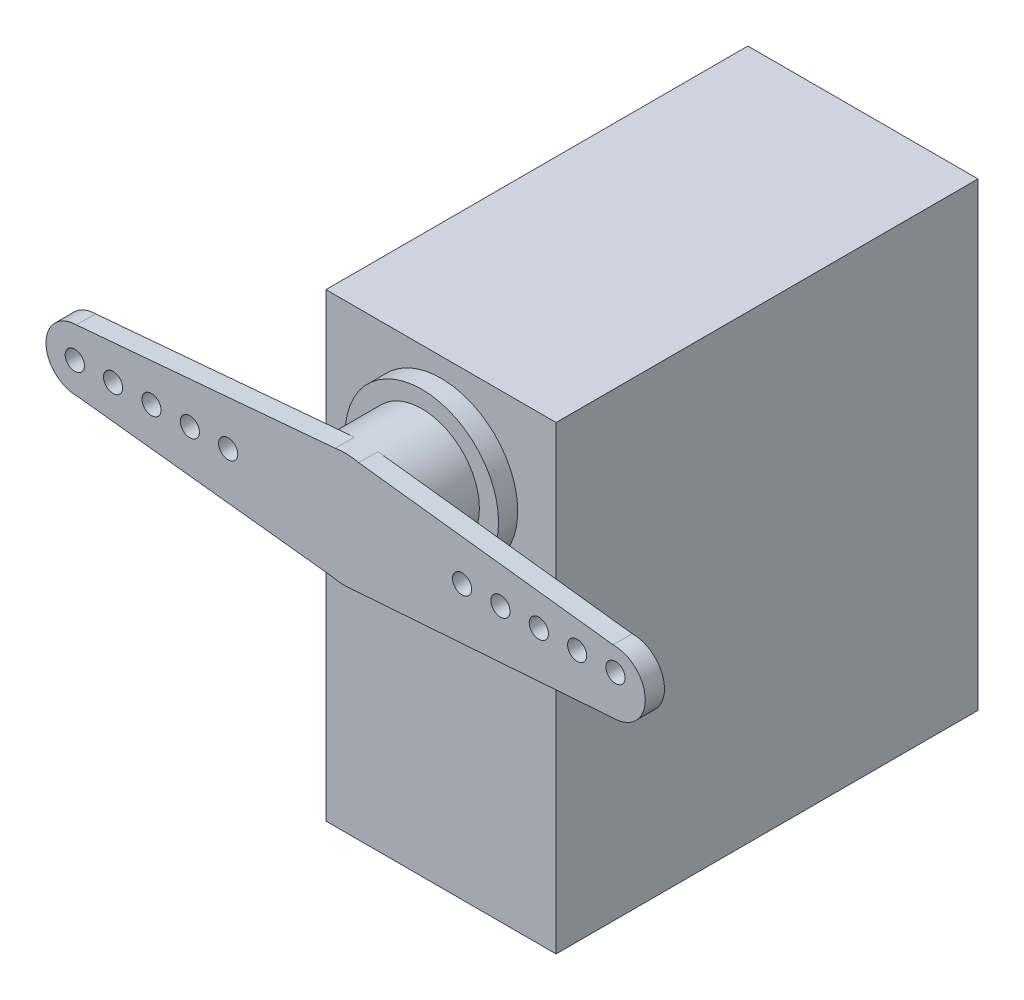
ISO-10303-21;
HEADER;
FILE_DESCRIPTION(('STEP AP214'),'2;1');
FILE_NAME('part.step','',(''),(''),'','','');
FILE_SCHEMA(('AUTOMOTIVE_DESIGN { 1 0 10303 214 1 1 1 1 }'));
ENDSEC;
DATA;
#1=APPLICATION_CONTEXT('core data for automotive mechanical design processes');
#2=APPLICATION_PROTOCOL_DEFINITION('international standard','automotive_design',2000,#1);
#3=PRODUCT_CONTEXT('',#1,'mechanical');
#4=PRODUCT('Part','Part','',(#3));
#5=PRODUCT_RELATED_PRODUCT_CATEGORY('part','',(#4));
#6=PRODUCT_DEFINITION_FORMATION('','',#4);
#7=PRODUCT_DEFINITION_CONTEXT('part definition',#1,'design');
#8=PRODUCT_DEFINITION('design','',#6,#7);
#9=PRODUCT_DEFINITION_SHAPE('','',#8);
#10=(LENGTH_UNIT() NAMED_UNIT(*) SI_UNIT(.MILLI.,.METRE.));
#11=(NAMED_UNIT(*) PLANE_ANGLE_UNIT() SI_UNIT($,.RADIAN.));
#12=(NAMED_UNIT(*) SI_UNIT($,.STERADIAN.) SOLID_ANGLE_UNIT());
#13=UNCERTAINTY_MEASURE_WITH_UNIT(LENGTH_MEASURE(1.E-05),#10,'distance_accuracy_value','');
#14=(GEOMETRIC_REPRESENTATION_CONTEXT(3) GLOBAL_UNCERTAINTY_ASSIGNED_CONTEXT((#13)) GLOBAL_UNIT_ASSIGNED_CONTEXT((#10,
#11,#12)) REPRESENTATION_CONTEXT('',''));
#15=CARTESIAN_POINT('',(0.,0.,0.));
#16=DIRECTION('',(0.,0.,1.));
#17=DIRECTION('',(1.,0.,0.));
#18=AXIS2_PLACEMENT_3D('',#15,#16,#17);
#19=CARTESIAN_POINT('',(0.,11.3080115103615,42.8625));
#20=DIRECTION('',(0.,0.,1.));
#21=DIRECTION('',(1.,0.,0.));
#22=AXIS2_PLACEMENT_3D('',#19,#20,#21);
#23=PLANE('',#22);
#24=CARTESIAN_POINT('',(12.8566753795651,11.526576547902,42.8625));
#25=DIRECTION('',(0.,0.,-1.));
#26=DIRECTION('',(-1.,0.,0.));
#27=AXIS2_PLACEMENT_3D('',#24,#25,#26);
#28=CIRCLE('',#27,0.793749999999999);
#29=CARTESIAN_POINT('',(12.0629253795651,11.526576547902,42.8625));
#30=VERTEX_POINT('',#29);
#31=EDGE_CURVE('E261',#30,#30,#28,.T.);
#32=ORIENTED_EDGE('',*,*,#31,.T.);
#33=EDGE_LOOP('',(#32));
#34=FACE_BOUND('',#33,.T.);
#35=CARTESIAN_POINT('',(19.2066753795651,11.526576547902,42.8625));
#36=DIRECTION('',(0.,0.,-1.));
#37=DIRECTION('',(-1.,0.,0.));
#38=AXIS2_PLACEMENT_3D('',#35,#36,#37);
#39=CIRCLE('',#38,0.793749999999999);
#40=CARTESIAN_POINT('',(18.4129253795651,11.526576547902,42.8625));
#41=VERTEX_POINT('',#40);
#42=EDGE_CURVE('E255',#41,#41,#39,.T.);
#43=ORIENTED_EDGE('',*,*,#42,.T.);
#44=EDGE_LOOP('',(#43));
#45=FACE_BOUND('',#44,.T.);
#46=CARTESIAN_POINT('',(-9.68167537956508,11.526576547902,42.8625));
#47=DIRECTION('',(0.,0.,1.));
#48=DIRECTION('',(1.,0.,0.));
#49=AXIS2_PLACEMENT_3D('',#46,#47,#48);
#50=CIRCLE('',#49,0.793749999999999);
#51=CARTESIAN_POINT('',(-8.88792537956508,11.526576547902,42.8625));
#52=VERTEX_POINT('',#51);
#53=EDGE_CURVE('E11',#52,#52,#50,.T.);
#54=ORIENTED_EDGE('',*,*,#53,.F.);
#55=EDGE_LOOP('',(#54));
#56=FACE_BOUND('',#55,.T.);
#57=CARTESIAN_POINT('',(-12.8566753795651,11.526576547902,42.8625));
#58=DIRECTION('',(0.,0.,1.));
#59=DIRECTION('',(1.,0.,0.));
#60=AXIS2_PLACEMENT_3D('',#57,#58,#59);
#61=CIRCLE('',#60,0.793749999999999);
#62=CARTESIAN_POINT('',(-12.0629253795651,11.526576547902,42.8625));
#63=VERTEX_POINT('',#62);
#64=EDGE_CURVE('E242',#63,#63,#61,.T.);
#65=ORIENTED_EDGE('',*,*,#64,.F.);
#66=EDGE_LOOP('',(#65));
#67=FACE_BOUND('',#66,.T.);
#68=CARTESIAN_POINT('',(-16.0316753795651,11.526576547902,42.8625));
#69=DIRECTION('',(0.,0.,1.));
#70=DIRECTION('',(1.,0.,0.));
#71=AXIS2_PLACEMENT_3D('',#68,#69,#70);
#72=CIRCLE('',#71,0.793749999999999);
#73=CARTESIAN_POINT('',(-15.2379253795651,11.526576547902,42.8625));
#74=VERTEX_POINT('',#73);
#75=EDGE_CURVE('E236',#74,#74,#72,.T.);
#76=ORIENTED_EDGE('',*,*,#75,.F.);
#77=EDGE_LOOP('',(#76));
#78=FACE_BOUND('',#77,.T.);
#79=CARTESIAN_POINT('',(0.,11.3080115103615,42.8625));
#80=DIRECTION('',(0.,0.,1.));
#81=DIRECTION('',(1.,0.,0.));
#82=AXIS2_PLACEMENT_3D('',#79,#80,#81);
#83=CIRCLE('',#82,4.7625);
#84=CARTESIAN_POINT('',(1.12632997121443,15.9354067869662,42.8625));
#85=VERTEX_POINT('',#84);
#86=CARTESIAN_POINT('',(-0.825456614691809,15.9984302152599,42.8625));
#87=VERTEX_POINT('',#86);
#88=EDGE_CURVE('E186',#85,#87,#83,.T.);
#89=ORIENTED_EDGE('',*,*,#88,.T.);
#90=DIRECTION('',(-0.996209019213887,-0.0869918963864186,0.));
#91=VECTOR('',#90,1.);
#92=CARTESIAN_POINT('',(0.,16.0705115103615,42.8625));
#93=LINE('',#92,#91);
#94=CARTESIAN_POINT('',(-22.2535877211341,14.1272628949348,42.8625));
#95=VERTEX_POINT('',#94);
#96=EDGE_CURVE('E160',#87,#95,#93,.T.);
#97=ORIENTED_EDGE('',*,*,#96,.T.);
#98=CARTESIAN_POINT('',(-22.225,11.5893423158934,42.8625));
#99=DIRECTION('',(0.,0.,1.));
#100=DIRECTION('',(-1.,0.,0.));
#101=AXIS2_PLACEMENT_3D('',#98,#99,#100);
#102=CIRCLE('',#101,2.53808158326739);
#103=CARTESIAN_POINT('',(-22.197271078555,9.05141220845616,42.8625));
#104=VERTEX_POINT('',#103);
#105=EDGE_CURVE('E142',#95,#104,#102,.T.);
#106=ORIENTED_EDGE('',*,*,#105,.T.);
#107=DIRECTION('',(0.993687935963306,-0.112179703694497,0.));
#108=VECTOR('',#107,1.);
#109=CARTESIAN_POINT('',(0.,6.54551151036146,42.8625));
#110=LINE('',#109,#108);
#111=CARTESIAN_POINT('',(-1.06176716355655,6.66537683375884,42.8625));
#112=VERTEX_POINT('',#111);
#113=EDGE_CURVE('E50',#104,#112,#110,.T.);
#114=ORIENTED_EDGE('',*,*,#113,.T.);
#115=CARTESIAN_POINT('',(0.69115450695835,6.5959300491056,42.8625));
#116=VERTEX_POINT('',#115);
#117=EDGE_CURVE('E189',#112,#116,#83,.T.);
#118=ORIENTED_EDGE('',*,*,#117,.T.);
#119=DIRECTION('',(0.99734984588783,0.0727549648307351,0.));
#120=VECTOR('',#119,1.);
#121=CARTESIAN_POINT('',(0.,6.54551151036146,42.8625));
#122=LINE('',#121,#120);
#123=CARTESIAN_POINT('',(22.2790718173163,8.17073168080962,42.8625));
#124=VERTEX_POINT('',#123);
#125=EDGE_CURVE('E165',#116,#124,#122,.T.);
#126=ORIENTED_EDGE('',*,*,#125,.T.);
#127=CARTESIAN_POINT('',(22.225,10.7903255048799,42.8625));
#128=DIRECTION('',(0.,0.,1.));
#129=DIRECTION('',(-1.,0.,0.));
#130=AXIS2_PLACEMENT_3D('',#127,#128,#129);
#131=CIRCLE('',#130,2.62015182089414);
#132=CARTESIAN_POINT('',(22.1792803615741,13.4100784091052,42.8625));
#133=VERTEX_POINT('',#132);
#134=EDGE_CURVE('E167',#124,#133,#131,.T.);
#135=ORIENTED_EDGE('',*,*,#134,.T.);
#136=DIRECTION('',(-0.992882559556449,0.119097535359192,0.));
#137=VECTOR('',#136,1.);
#138=CARTESIAN_POINT('',(0.,16.0705115103615,42.8625));
#139=LINE('',#138,#137);
#140=EDGE_CURVE('E57',#133,#85,#139,.T.);
#141=ORIENTED_EDGE('',*,*,#140,.T.);
#142=EDGE_LOOP('',(#89,#97,#106,#114,#118,#126,#135,#141));
#143=FACE_BOUND('',#142,.T.);
#144=CARTESIAN_POINT('',(-22.3816753795651,11.526576547902,42.8625));
#145=DIRECTION('',(0.,0.,1.));
#146=DIRECTION('',(1.,0.,0.));
#147=AXIS2_PLACEMENT_3D('',#144,#145,#146);
#148=CIRCLE('',#147,0.793749999999999);
#149=CARTESIAN_POINT('',(-21.5879253795651,11.526576547902,42.8625));
#150=VERTEX_POINT('',#149);
#151=EDGE_CURVE('E232',#150,#150,#148,.T.);
#152=ORIENTED_EDGE('',*,*,#151,.F.);
#153=EDGE_LOOP('',(#152));
#154=FACE_BOUND('',#153,.T.);
#155=CARTESIAN_POINT('',(-19.2066753795651,11.526576547902,42.8625));
#156=DIRECTION('',(0.,0.,1.));
#157=DIRECTION('',(1.,0.,0.));
#158=AXIS2_PLACEMENT_3D('',#155,#156,#157);
#159=CIRCLE('',#158,0.793749999999999);
#160=CARTESIAN_POINT('',(-18.4129253795651,11.526576547902,42.8625));
#161=VERTEX_POINT('',#160);
#162=EDGE_CURVE('E280',#161,#161,#159,.T.);
#163=ORIENTED_EDGE('',*,*,#162,.F.);
#164=EDGE_LOOP('',(#163));
#165=FACE_BOUND('',#164,.T.);
#166=CARTESIAN_POINT('',(22.3816753795651,11.526576547902,42.8625));
#167=DIRECTION('',(0.,0.,-1.));
#168=DIRECTION('',(-1.,0.,0.));
#169=AXIS2_PLACEMENT_3D('',#166,#167,#168);
#170=CIRCLE('',#169,0.793749999999999);
#171=CARTESIAN_POINT('',(21.5879253795651,11.526576547902,42.8625));
#172=VERTEX_POINT('',#171);
#173=EDGE_CURVE('E251',#172,#172,#170,.T.);
#174=ORIENTED_EDGE('',*,*,#173,.T.);
#175=EDGE_LOOP('',(#174));
#176=FACE_BOUND('',#175,.T.);
#177=CARTESIAN_POINT('',(16.0316753795651,11.526576547902,42.8625));
#178=DIRECTION('',(0.,0.,-1.));
#179=DIRECTION('',(-1.,0.,0.));
#180=AXIS2_PLACEMENT_3D('',#177,#178,#179);
#181=CIRCLE('',#180,0.793749999999999);
#182=CARTESIAN_POINT('',(15.2379253795651,11.526576547902,42.8625));
#183=VERTEX_POINT('',#182);
#184=EDGE_CURVE('E258',#183,#183,#181,.T.);
#185=ORIENTED_EDGE('',*,*,#184,.T.);
#186=EDGE_LOOP('',(#185));
#187=FACE_BOUND('',#186,.T.);
#188=CARTESIAN_POINT('',(9.68167537956508,11.526576547902,42.8625));
#189=DIRECTION('',(0.,0.,-1.));
#190=DIRECTION('',(-1.,0.,0.));
#191=AXIS2_PLACEMENT_3D('',#188,#189,#190);
#192=CIRCLE('',#191,0.793749999999999);
#193=CARTESIAN_POINT('',(8.88792537956508,11.526576547902,42.8625));
#194=VERTEX_POINT('',#193);
#195=EDGE_CURVE('E271',#194,#194,#192,.T.);
#196=ORIENTED_EDGE('',*,*,#195,.T.);
#197=EDGE_LOOP('',(#196));
#198=FACE_BOUND('',#197,.T.);
#199=ADVANCED_FACE('F33',(#34,#45,#56,#67,#78,#143,#154,#165,#176,#187,#198),#23,.T.);
#200=CARTESIAN_POINT('',(22.225,10.7903255048799,41.275));
#201=DIRECTION('',(0.,0.,-1.));
#202=DIRECTION('',(-1.,0.,0.));
#203=AXIS2_PLACEMENT_3D('',#200,#201,#202);
#204=PLANE('',#203);
#205=CARTESIAN_POINT('',(12.8566753795651,11.526576547902,41.275));
#206=DIRECTION('',(0.,0.,-1.));
#207=DIRECTION('',(-1.,0.,0.));
#208=AXIS2_PLACEMENT_3D('',#205,#206,#207);
#209=CIRCLE('',#208,0.793749999999999);
#210=CARTESIAN_POINT('',(12.0629253795651,11.526576547902,41.275));
#211=VERTEX_POINT('',#210);
#212=EDGE_CURVE('E259',#211,#211,#209,.F.);
#213=ORIENTED_EDGE('',*,*,#212,.T.);
#214=EDGE_LOOP('',(#213));
#215=FACE_BOUND('',#214,.T.);
#216=CARTESIAN_POINT('',(19.2066753795651,11.526576547902,41.275));
#217=DIRECTION('',(0.,0.,-1.));
#218=DIRECTION('',(-1.,0.,0.));
#219=AXIS2_PLACEMENT_3D('',#216,#217,#218);
#220=CIRCLE('',#219,0.793749999999999);
#221=CARTESIAN_POINT('',(18.4129253795651,11.526576547902,41.275));
#222=VERTEX_POINT('',#221);
#223=EDGE_CURVE('E252',#222,#222,#220,.F.);
#224=ORIENTED_EDGE('',*,*,#223,.T.);
#225=EDGE_LOOP('',(#224));
#226=FACE_BOUND('',#225,.T.);
#227=CARTESIAN_POINT('',(0.,11.3080115103615,41.275));
#228=DIRECTION('',(0.,0.,-1.));
#229=DIRECTION('',(-1.,0.,0.));
#230=AXIS2_PLACEMENT_3D('',#227,#228,#229);
#231=CIRCLE('',#230,4.7625);
#232=CARTESIAN_POINT('',(1.12632997121444,15.9354067869662,41.275));
#233=VERTEX_POINT('',#232);
#234=CARTESIAN_POINT('',(0.691154506958359,6.5959300491056,41.275));
#235=VERTEX_POINT('',#234);
#236=EDGE_CURVE('E229',#233,#235,#231,.T.);
#237=ORIENTED_EDGE('',*,*,#236,.F.);
#238=DIRECTION('',(-0.992882559556449,0.119097535359192,0.));
#239=VECTOR('',#238,1.);
#240=CARTESIAN_POINT('',(0.,16.0705115103615,41.275));
#241=LINE('',#240,#239);
#242=CARTESIAN_POINT('',(22.1792803615741,13.4100784091052,41.275));
#243=VERTEX_POINT('',#242);
#244=EDGE_CURVE('E137',#243,#233,#241,.T.);
#245=ORIENTED_EDGE('',*,*,#244,.F.);
#246=CARTESIAN_POINT('',(22.225,10.7903255048799,41.275));
#247=DIRECTION('',(0.,0.,1.));
#248=DIRECTION('',(-1.,0.,0.));
#249=AXIS2_PLACEMENT_3D('',#246,#247,#248);
#250=CIRCLE('',#249,2.62015182089414);
#251=CARTESIAN_POINT('',(22.2790718173163,8.17073168080962,41.275));
#252=VERTEX_POINT('',#251);
#253=EDGE_CURVE('E144',#252,#243,#250,.T.);
#254=ORIENTED_EDGE('',*,*,#253,.F.);
#255=DIRECTION('',(0.99734984588783,0.0727549648307351,0.));
#256=VECTOR('',#255,1.);
#257=CARTESIAN_POINT('',(0.,6.54551151036146,41.275));
#258=LINE('',#257,#256);
#259=EDGE_CURVE('E152',#235,#252,#258,.T.);
#260=ORIENTED_EDGE('',*,*,#259,.F.);
#261=EDGE_LOOP('',(#237,#245,#254,#260));
#262=FACE_BOUND('',#261,.T.);
#263=CARTESIAN_POINT('',(22.3816753795651,11.526576547902,41.275));
#264=DIRECTION('',(0.,0.,-1.));
#265=DIRECTION('',(-1.,0.,0.));
#266=AXIS2_PLACEMENT_3D('',#263,#264,#265);
#267=CIRCLE('',#266,0.793749999999999);
#268=CARTESIAN_POINT('',(21.5879253795651,11.526576547902,41.275));
#269=VERTEX_POINT('',#268);
#270=EDGE_CURVE('E247',#269,#269,#267,.F.);
#271=ORIENTED_EDGE('',*,*,#270,.T.);
#272=EDGE_LOOP('',(#271));
#273=FACE_BOUND('',#272,.T.);
#274=CARTESIAN_POINT('',(16.0316753795651,11.526576547902,41.275));
#275=DIRECTION('',(0.,0.,-1.));
#276=DIRECTION('',(-1.,0.,0.));
#277=AXIS2_PLACEMENT_3D('',#274,#275,#276);
#278=CIRCLE('',#277,0.793749999999999);
#279=CARTESIAN_POINT('',(15.2379253795651,11.526576547902,41.275));
#280=VERTEX_POINT('',#279);
#281=EDGE_CURVE('E256',#280,#280,#278,.F.);
#282=ORIENTED_EDGE('',*,*,#281,.T.);
#283=EDGE_LOOP('',(#282));
#284=FACE_BOUND('',#283,.T.);
#285=CARTESIAN_POINT('',(9.68167537956508,11.526576547902,41.275));
#286=DIRECTION('',(0.,0.,-1.));
#287=DIRECTION('',(-1.,0.,0.));
#288=AXIS2_PLACEMENT_3D('',#285,#286,#287);
#289=CIRCLE('',#288,0.793749999999999);
#290=CARTESIAN_POINT('',(8.88792537956508,11.526576547902,41.275));
#291=VERTEX_POINT('',#290);
#292=EDGE_CURVE('E37',#291,#291,#289,.F.);
#293=ORIENTED_EDGE('',*,*,#292,.T.);
#294=EDGE_LOOP('',(#293));
#295=FACE_BOUND('',#294,.T.);
#296=ADVANCED_FACE('F297',(#215,#226,#262,#273,#284,#295),#204,.T.);
#297=CARTESIAN_POINT('',(0.,11.1125,36.5125));
#298=DIRECTION('',(0.,0.,1.));
#299=DIRECTION('',(1.,0.,0.));
#300=AXIS2_PLACEMENT_3D('',#297,#298,#299);
#301=PLANE('',#300);
#302=CARTESIAN_POINT('',(0.,11.1125,36.5125));
#303=DIRECTION('',(0.,0.,1.));
#304=DIRECTION('',(1.,0.,0.));
#305=AXIS2_PLACEMENT_3D('',#302,#303,#304);
#306=CIRCLE('',#305,6.35);
#307=CARTESIAN_POINT('',(6.35,11.1125,36.5125));
#308=VERTEX_POINT('',#307);
#309=EDGE_CURVE('E188',#308,#308,#306,.T.);
#310=ORIENTED_EDGE('',*,*,#309,.T.);
#311=EDGE_LOOP('',(#310));
#312=FACE_BOUND('',#311,.T.);
#313=CARTESIAN_POINT('',(0.,11.3080115103615,36.5125));
#314=DIRECTION('',(0.,0.,1.));
#315=DIRECTION('',(1.,0.,0.));
#316=AXIS2_PLACEMENT_3D('',#313,#314,#315);
#317=CIRCLE('',#316,4.7625);
#318=CARTESIAN_POINT('',(4.7625,11.3080115103615,36.5125));
#319=VERTEX_POINT('',#318);
#320=EDGE_CURVE('E185',#319,#319,#317,.T.);
#321=ORIENTED_EDGE('',*,*,#320,.F.);
#322=EDGE_LOOP('',(#321));
#323=FACE_BOUND('',#322,.T.);
#324=ADVANCED_FACE('F346',(#312,#323),#301,.T.);
#325=CARTESIAN_POINT('',(9.52499999999999,19.05,34.925));
#326=DIRECTION('',(0.,0.,-1.));
#327=DIRECTION('',(-1.,0.,0.));
#328=AXIS2_PLACEMENT_3D('',#325,#326,#327);
#329=PLANE('',#328);
#330=DIRECTION('',(0.,1.,0.));
#331=VECTOR('',#330,1.);
#332=CARTESIAN_POINT('',(9.525,-19.05,34.925));
#333=LINE('',#332,#331);
#334=CARTESIAN_POINT('',(9.525,-19.05,34.925));
#335=VERTEX_POINT('',#334);
#336=CARTESIAN_POINT('',(9.525,19.05,34.925));
#337=VERTEX_POINT('',#336);
#338=EDGE_CURVE('E195',#335,#337,#333,.T.);
#339=ORIENTED_EDGE('',*,*,#338,.T.);
#340=DIRECTION('',(-1.,0.,0.));
#341=VECTOR('',#340,1.);
#342=CARTESIAN_POINT('',(-9.525,19.05,34.925));
#343=LINE('',#342,#341);
#344=CARTESIAN_POINT('',(-9.525,19.05,34.925));
#345=VERTEX_POINT('',#344);
#346=EDGE_CURVE('E198',#337,#345,#343,.T.);
#347=ORIENTED_EDGE('',*,*,#346,.T.);
#348=DIRECTION('',(0.,-1.,0.));
#349=VECTOR('',#348,1.);
#350=CARTESIAN_POINT('',(-9.525,-19.05,34.925));
#351=LINE('',#350,#349);
#352=CARTESIAN_POINT('',(-9.525,-19.05,34.925));
#353=VERTEX_POINT('',#352);
#354=EDGE_CURVE('E201',#345,#353,#351,.T.);
#355=ORIENTED_EDGE('',*,*,#354,.T.);
#356=DIRECTION('',(1.,0.,0.));
#357=VECTOR('',#356,1.);
#358=CARTESIAN_POINT('',(-9.525,-19.05,34.925));
#359=LINE('',#358,#357);
#360=EDGE_CURVE('E203',#353,#335,#359,.T.);
#361=ORIENTED_EDGE('',*,*,#360,.T.);
#362=EDGE_LOOP('',(#339,#347,#355,#361));
#363=FACE_BOUND('',#362,.T.);
#364=CARTESIAN_POINT('',(0.,11.1125,34.925));
#365=DIRECTION('',(0.,0.,-1.));
#366=DIRECTION('',(-1.,0.,0.));
#367=AXIS2_PLACEMENT_3D('',#364,#365,#366);
#368=CIRCLE('',#367,6.35);
#369=CARTESIAN_POINT('',(-6.35,11.1125,34.925));
#370=VERTEX_POINT('',#369);
#371=EDGE_CURVE('E224',#370,#370,#368,.F.);
#372=ORIENTED_EDGE('',*,*,#371,.F.);
#373=EDGE_LOOP('',(#372));
#374=FACE_BOUND('',#373,.T.);
#375=ADVANCED_FACE('F369',(#363,#374),#329,.F.);
#376=CARTESIAN_POINT('',(9.525,-19.05,34.925));
#377=DIRECTION('',(-1.,0.,0.));
#378=DIRECTION('',(0.,0.,1.));
#379=AXIS2_PLACEMENT_3D('',#376,#377,#378);
#380=PLANE('',#379);
#381=DIRECTION('',(0.,1.,0.));
#382=VECTOR('',#381,1.);
#383=CARTESIAN_POINT('',(9.525,-19.05,0.));
#384=LINE('',#383,#382);
#385=CARTESIAN_POINT('',(9.525,-19.05,0.));
#386=VERTEX_POINT('',#385);
#387=CARTESIAN_POINT('',(9.525,19.05,0.));
#388=VERTEX_POINT('',#387);
#389=EDGE_CURVE('E194',#386,#388,#384,.T.);
#390=ORIENTED_EDGE('',*,*,#389,.T.);
#391=DIRECTION('',(0.,0.,-1.));
#392=VECTOR('',#391,1.);
#393=CARTESIAN_POINT('',(9.525,19.05,34.925));
#394=LINE('',#393,#392);
#395=EDGE_CURVE('E221',#337,#388,#394,.T.);
#396=ORIENTED_EDGE('',*,*,#395,.F.);
#397=ORIENTED_EDGE('',*,*,#338,.F.);
#398=DIRECTION('',(0.,0.,-1.));
#399=VECTOR('',#398,1.);
#400=CARTESIAN_POINT('',(9.525,-19.05,34.925));
#401=LINE('',#400,#399);
#402=EDGE_CURVE('E205',#335,#386,#401,.T.);
#403=ORIENTED_EDGE('',*,*,#402,.T.);
#404=EDGE_LOOP('',(#390,#396,#397,#403));
#405=FACE_BOUND('',#404,.T.);
#406=ADVANCED_FACE('F377',(#405),#380,.F.);
#407=CARTESIAN_POINT('',(-9.525,19.05,34.925));
#408=DIRECTION('',(0.,-1.,0.));
#409=DIRECTION('',(0.,0.,-1.));
#410=AXIS2_PLACEMENT_3D('',#407,#408,#409);
#411=PLANE('',#410);
#412=DIRECTION('',(-1.,0.,0.));
#413=VECTOR('',#412,1.);
#414=CARTESIAN_POINT('',(-9.525,19.05,0.));
#415=LINE('',#414,#413);
#416=CARTESIAN_POINT('',(-9.525,19.05,0.));
#417=VERTEX_POINT('',#416);
#418=EDGE_CURVE('E208',#388,#417,#415,.T.);
#419=ORIENTED_EDGE('',*,*,#418,.T.);
#420=DIRECTION('',(0.,0.,-1.));
#421=VECTOR('',#420,1.);
#422=CARTESIAN_POINT('',(-9.525,19.05,34.925));
#423=LINE('',#422,#421);
#424=EDGE_CURVE('E218',#345,#417,#423,.T.);
#425=ORIENTED_EDGE('',*,*,#424,.F.);
#426=ORIENTED_EDGE('',*,*,#346,.F.);
#427=ORIENTED_EDGE('',*,*,#395,.T.);
#428=EDGE_LOOP('',(#419,#425,#426,#427));
#429=FACE_BOUND('',#428,.T.);
#430=ADVANCED_FACE('F389',(#429),#411,.F.);
#431=CARTESIAN_POINT('',(-9.525,-19.05,34.925));
#432=DIRECTION('',(1.,0.,0.));
#433=DIRECTION('',(0.,0.,-1.));
#434=AXIS2_PLACEMENT_3D('',#431,#432,#433);
#435=PLANE('',#434);
#436=DIRECTION('',(0.,-1.,0.));
#437=VECTOR('',#436,1.);
#438=CARTESIAN_POINT('',(-9.525,-19.05,0.));
#439=LINE('',#438,#437);
#440=CARTESIAN_POINT('',(-9.525,-19.05,0.));
#441=VERTEX_POINT('',#440);
#442=EDGE_CURVE('E210',#417,#441,#439,.T.);
#443=ORIENTED_EDGE('',*,*,#442,.T.);
#444=DIRECTION('',(0.,0.,-1.));
#445=VECTOR('',#444,1.);
#446=CARTESIAN_POINT('',(-9.525,-19.05,34.925));
#447=LINE('',#446,#445);
#448=EDGE_CURVE('E215',#353,#441,#447,.T.);
#449=ORIENTED_EDGE('',*,*,#448,.F.);
#450=ORIENTED_EDGE('',*,*,#354,.F.);
#451=ORIENTED_EDGE('',*,*,#424,.T.);
#452=EDGE_LOOP('',(#443,#449,#450,#451));
#453=FACE_BOUND('',#452,.T.);
#454=ADVANCED_FACE('F385',(#453),#435,.F.);
#455=CARTESIAN_POINT('',(-9.525,-19.05,34.925));
#456=DIRECTION('',(0.,1.,0.));
#457=DIRECTION('',(0.,0.,1.));
#458=AXIS2_PLACEMENT_3D('',#455,#456,#457);
#459=PLANE('',#458);
#460=DIRECTION('',(1.,0.,0.));
#461=VECTOR('',#460,1.);
#462=CARTESIAN_POINT('',(-9.525,-19.05,0.));
#463=LINE('',#462,#461);
#464=EDGE_CURVE('E199',#441,#386,#463,.T.);
#465=ORIENTED_EDGE('',*,*,#464,.T.);
#466=ORIENTED_EDGE('',*,*,#402,.F.);
#467=ORIENTED_EDGE('',*,*,#360,.F.);
#468=ORIENTED_EDGE('',*,*,#448,.T.);
#469=EDGE_LOOP('',(#465,#466,#467,#468));
#470=FACE_BOUND('',#469,.T.);
#471=ADVANCED_FACE('F381',(#470),#459,.F.);
#472=CARTESIAN_POINT('',(9.52499999999999,19.05,0.));
#473=DIRECTION('',(0.,0.,-1.));
#474=DIRECTION('',(-1.,0.,0.));
#475=AXIS2_PLACEMENT_3D('',#472,#473,#474);
#476=PLANE('',#475);
#477=ORIENTED_EDGE('',*,*,#389,.F.);
#478=ORIENTED_EDGE('',*,*,#464,.F.);
#479=ORIENTED_EDGE('',*,*,#442,.F.);
#480=ORIENTED_EDGE('',*,*,#418,.F.);
#481=EDGE_LOOP('',(#477,#478,#479,#480));
#482=FACE_BOUND('',#481,.T.);
#483=ADVANCED_FACE('F373',(#482),#476,.T.);
#484=CARTESIAN_POINT('',(0.,11.1125,36.5125));
#485=DIRECTION('',(0.,0.,-1.));
#486=DIRECTION('',(-1.,0.,0.));
#487=AXIS2_PLACEMENT_3D('',#484,#485,#486);
#488=CYLINDRICAL_SURFACE('',#487,6.35);
#489=ORIENTED_EDGE('',*,*,#309,.F.);
#490=EDGE_LOOP('',(#489));
#491=FACE_BOUND('',#490,.T.);
#492=ORIENTED_EDGE('',*,*,#371,.T.);
#493=EDGE_LOOP('',(#492));
#494=FACE_BOUND('',#493,.T.);
#495=ADVANCED_FACE('F366',(#491,#494),#488,.T.);
#496=CARTESIAN_POINT('',(0.,11.3080115103615,42.8625));
#497=DIRECTION('',(0.,0.,-1.));
#498=DIRECTION('',(-1.,0.,0.));
#499=AXIS2_PLACEMENT_3D('',#496,#497,#498);
#500=CYLINDRICAL_SURFACE('',#499,4.7625);
#501=DIRECTION('',(0.,0.,-1.));
#502=VECTOR('',#501,1.);
#503=CARTESIAN_POINT('',(0.691154506958384,6.5959300491056,42.8625));
#504=LINE('',#503,#502);
#505=EDGE_CURVE('E179',#235,#116,#504,.F.);
#506=ORIENTED_EDGE('',*,*,#505,.T.);
#507=ORIENTED_EDGE('',*,*,#117,.F.);
#508=DIRECTION('',(0.,0.,-1.));
#509=VECTOR('',#508,1.);
#510=CARTESIAN_POINT('',(-1.06176716355655,6.66537683375884,42.8625));
#511=LINE('',#510,#509);
#512=CARTESIAN_POINT('',(-1.06176716355655,6.66537683375884,41.275));
#513=VERTEX_POINT('',#512);
#514=EDGE_CURVE('E176',#112,#513,#511,.T.);
#515=ORIENTED_EDGE('',*,*,#514,.T.);
#516=CARTESIAN_POINT('',(-0.825456614691829,15.9984302152599,41.275));
#517=VERTEX_POINT('',#516);
#518=EDGE_CURVE('E227',#513,#517,#231,.T.);
#519=ORIENTED_EDGE('',*,*,#518,.T.);
#520=DIRECTION('',(0.,0.,-1.));
#521=VECTOR('',#520,1.);
#522=CARTESIAN_POINT('',(-0.825456614691809,15.9984302152599,42.8625));
#523=LINE('',#522,#521);
#524=EDGE_CURVE('E132',#517,#87,#523,.F.);
#525=ORIENTED_EDGE('',*,*,#524,.T.);
#526=ORIENTED_EDGE('',*,*,#88,.F.);
#527=DIRECTION('',(0.,0.,-1.));
#528=VECTOR('',#527,1.);
#529=CARTESIAN_POINT('',(1.12632997121443,15.9354067869662,42.8625));
#530=LINE('',#529,#528);
#531=EDGE_CURVE('E182',#85,#233,#530,.T.);
#532=ORIENTED_EDGE('',*,*,#531,.T.);
#533=ORIENTED_EDGE('',*,*,#236,.T.);
#534=EDGE_LOOP('',(#506,#507,#515,#519,#525,#526,#532,#533));
#535=FACE_BOUND('',#534,.T.);
#536=ORIENTED_EDGE('',*,*,#320,.T.);
#537=EDGE_LOOP('',(#536));
#538=FACE_BOUND('',#537,.T.);
#539=ADVANCED_FACE('F293',(#535,#538),#500,.T.);
#540=CARTESIAN_POINT('',(-22.225,11.5893423158934,41.275));
#541=DIRECTION('',(0.,0.,1.));
#542=DIRECTION('',(1.,0.,0.));
#543=AXIS2_PLACEMENT_3D('',#540,#541,#542);
#544=CYLINDRICAL_SURFACE('',#543,2.53808158326739);
#545=ORIENTED_EDGE('',*,*,#105,.F.);
#546=DIRECTION('',(0.,0.,1.));
#547=VECTOR('',#546,1.);
#548=CARTESIAN_POINT('',(-22.2535877211341,14.1272628949348,41.275));
#549=LINE('',#548,#547);
#550=CARTESIAN_POINT('',(-22.2535877211341,14.1272628949348,41.275));
#551=VERTEX_POINT('',#550);
#552=EDGE_CURVE('E129',#551,#95,#549,.T.);
#553=ORIENTED_EDGE('',*,*,#552,.F.);
#554=CARTESIAN_POINT('',(-22.225,11.5893423158934,41.275));
#555=DIRECTION('',(0.,0.,1.));
#556=DIRECTION('',(-1.,0.,0.));
#557=AXIS2_PLACEMENT_3D('',#554,#555,#556);
#558=CIRCLE('',#557,2.53808158326739);
#559=CARTESIAN_POINT('',(-22.197271078555,9.05141220845616,41.275));
#560=VERTEX_POINT('',#559);
#561=EDGE_CURVE('E136',#551,#560,#558,.T.);
#562=ORIENTED_EDGE('',*,*,#561,.T.);
#563=DIRECTION('',(0.,0.,1.));
#564=VECTOR('',#563,1.);
#565=CARTESIAN_POINT('',(-22.197271078555,9.05141220845616,41.275));
#566=LINE('',#565,#564);
#567=EDGE_CURVE('E143',#560,#104,#566,.T.);
#568=ORIENTED_EDGE('',*,*,#567,.T.);
#569=EDGE_LOOP('',(#545,#553,#562,#568));
#570=FACE_BOUND('',#569,.T.);
#571=ADVANCED_FACE('F141',(#570),#544,.T.);
#572=CARTESIAN_POINT('',(-19.2066753795651,11.526576547902,41.275));
#573=DIRECTION('',(0.,0.,-1.));
#574=DIRECTION('',(-1.,0.,0.));
#575=AXIS2_PLACEMENT_3D('',#572,#573,#574);
#576=CIRCLE('',#575,0.793749999999999);
#577=CARTESIAN_POINT('',(-20.0004253795651,11.526576547902,41.275));
#578=VERTEX_POINT('',#577);
#579=EDGE_CURVE('E250',#578,#578,#576,.T.);
#580=ORIENTED_EDGE('',*,*,#579,.F.);
#581=EDGE_LOOP('',(#580));
#582=FACE_BOUND('',#581,.T.);
#583=CARTESIAN_POINT('',(-22.3816753795651,11.526576547902,41.275));
#584=DIRECTION('',(0.,0.,-1.));
#585=DIRECTION('',(-1.,0.,0.));
#586=AXIS2_PLACEMENT_3D('',#583,#584,#585);
#587=CIRCLE('',#586,0.793749999999999);
#588=CARTESIAN_POINT('',(-23.1754253795651,11.526576547902,41.275));
#589=VERTEX_POINT('',#588);
#590=EDGE_CURVE('E161',#589,#589,#587,.T.);
#591=ORIENTED_EDGE('',*,*,#590,.F.);
#592=EDGE_LOOP('',(#591));
#593=FACE_BOUND('',#592,.T.);
#594=ORIENTED_EDGE('',*,*,#518,.F.);
#595=DIRECTION('',(0.993687935963306,-0.112179703694497,0.));
#596=VECTOR('',#595,1.);
#597=CARTESIAN_POINT('',(0.,6.54551151036146,41.275));
#598=LINE('',#597,#596);
#599=EDGE_CURVE('E150',#560,#513,#598,.T.);
#600=ORIENTED_EDGE('',*,*,#599,.F.);
#601=ORIENTED_EDGE('',*,*,#561,.F.);
#602=DIRECTION('',(-0.996209019213887,-0.0869918963864186,0.));
#603=VECTOR('',#602,1.);
#604=CARTESIAN_POINT('',(0.,16.0705115103615,41.275));
#605=LINE('',#604,#603);
#606=EDGE_CURVE('E125',#517,#551,#605,.T.);
#607=ORIENTED_EDGE('',*,*,#606,.F.);
#608=EDGE_LOOP('',(#594,#600,#601,#607));
#609=FACE_BOUND('',#608,.T.);
#610=CARTESIAN_POINT('',(-16.0316753795651,11.526576547902,41.275));
#611=DIRECTION('',(0.,0.,-1.));
#612=DIRECTION('',(-1.,0.,0.));
#613=AXIS2_PLACEMENT_3D('',#610,#611,#612);
#614=CIRCLE('',#613,0.793749999999999);
#615=CARTESIAN_POINT('',(-16.8254253795651,11.526576547902,41.275));
#616=VERTEX_POINT('',#615);
#617=EDGE_CURVE('E233',#616,#616,#614,.T.);
#618=ORIENTED_EDGE('',*,*,#617,.F.);
#619=EDGE_LOOP('',(#618));
#620=FACE_BOUND('',#619,.T.);
#621=CARTESIAN_POINT('',(-12.8566753795651,11.526576547902,41.275));
#622=DIRECTION('',(0.,0.,-1.));
#623=DIRECTION('',(-1.,0.,0.));
#624=AXIS2_PLACEMENT_3D('',#621,#622,#623);
#625=CIRCLE('',#624,0.793749999999999);
#626=CARTESIAN_POINT('',(-13.6504253795651,11.526576547902,41.275));
#627=VERTEX_POINT('',#626);
#628=EDGE_CURVE('E239',#627,#627,#625,.T.);
#629=ORIENTED_EDGE('',*,*,#628,.F.);
#630=EDGE_LOOP('',(#629));
#631=FACE_BOUND('',#630,.T.);
#632=CARTESIAN_POINT('',(-9.68167537956508,11.526576547902,41.275));
#633=DIRECTION('',(0.,0.,-1.));
#634=DIRECTION('',(-1.,0.,0.));
#635=AXIS2_PLACEMENT_3D('',#632,#633,#634);
#636=CIRCLE('',#635,0.793749999999999);
#637=CARTESIAN_POINT('',(-10.4754253795651,11.526576547902,41.275));
#638=VERTEX_POINT('',#637);
#639=EDGE_CURVE('E42',#638,#638,#636,.T.);
#640=ORIENTED_EDGE('',*,*,#639,.F.);
#641=EDGE_LOOP('',(#640));
#642=FACE_BOUND('',#641,.T.);
#643=ADVANCED_FACE('F147',(#582,#593,#609,#620,#631,#642),#204,.T.);
#644=CARTESIAN_POINT('',(0.,16.0705115103615,41.275));
#645=DIRECTION('',(-0.0869918963864186,0.996209019213887,0.));
#646=DIRECTION('',(-0.996209019213887,-0.0869918963864186,0.));
#647=AXIS2_PLACEMENT_3D('',#644,#645,#646);
#648=PLANE('',#647);
#649=ORIENTED_EDGE('',*,*,#524,.F.);
#650=ORIENTED_EDGE('',*,*,#606,.T.);
#651=ORIENTED_EDGE('',*,*,#552,.T.);
#652=ORIENTED_EDGE('',*,*,#96,.F.);
#653=EDGE_LOOP('',(#649,#650,#651,#652));
#654=FACE_BOUND('',#653,.T.);
#655=ADVANCED_FACE('F127',(#654),#648,.T.);
#656=CARTESIAN_POINT('',(0.,6.54551151036146,41.275));
#657=DIRECTION('',(-0.112179703694497,-0.993687935963306,0.));
#658=DIRECTION('',(0.993687935963306,-0.112179703694497,0.));
#659=AXIS2_PLACEMENT_3D('',#656,#657,#658);
#660=PLANE('',#659);
#661=ORIENTED_EDGE('',*,*,#514,.F.);
#662=ORIENTED_EDGE('',*,*,#113,.F.);
#663=ORIENTED_EDGE('',*,*,#567,.F.);
#664=ORIENTED_EDGE('',*,*,#599,.T.);
#665=EDGE_LOOP('',(#661,#662,#663,#664));
#666=FACE_BOUND('',#665,.T.);
#667=ADVANCED_FACE('F354',(#666),#660,.T.);
#668=CARTESIAN_POINT('',(0.,16.0705115103615,41.275));
#669=DIRECTION('',(0.119097535359192,0.992882559556449,0.));
#670=DIRECTION('',(-0.992882559556449,0.119097535359192,0.));
#671=AXIS2_PLACEMENT_3D('',#668,#669,#670);
#672=PLANE('',#671);
#673=ORIENTED_EDGE('',*,*,#531,.F.);
#674=ORIENTED_EDGE('',*,*,#140,.F.);
#675=DIRECTION('',(0.,0.,1.));
#676=VECTOR('',#675,1.);
#677=CARTESIAN_POINT('',(22.1792803615741,13.4100784091052,41.275));
#678=LINE('',#677,#676);
#679=EDGE_CURVE('E169',#243,#133,#678,.T.);
#680=ORIENTED_EDGE('',*,*,#679,.F.);
#681=ORIENTED_EDGE('',*,*,#244,.T.);
#682=EDGE_LOOP('',(#673,#674,#680,#681));
#683=FACE_BOUND('',#682,.T.);
#684=ADVANCED_FACE('F287',(#683),#672,.T.);
#685=CARTESIAN_POINT('',(0.,6.54551151036146,41.275));
#686=DIRECTION('',(0.0727549648307351,-0.99734984588783,0.));
#687=DIRECTION('',(0.99734984588783,0.0727549648307351,0.));
#688=AXIS2_PLACEMENT_3D('',#685,#686,#687);
#689=PLANE('',#688);
#690=ORIENTED_EDGE('',*,*,#505,.F.);
#691=ORIENTED_EDGE('',*,*,#259,.T.);
#692=DIRECTION('',(0.,0.,1.));
#693=VECTOR('',#692,1.);
#694=CARTESIAN_POINT('',(22.2790718173163,8.17073168080962,41.275));
#695=LINE('',#694,#693);
#696=EDGE_CURVE('E171',#252,#124,#695,.T.);
#697=ORIENTED_EDGE('',*,*,#696,.T.);
#698=ORIENTED_EDGE('',*,*,#125,.F.);
#699=EDGE_LOOP('',(#690,#691,#697,#698));
#700=FACE_BOUND('',#699,.T.);
#701=ADVANCED_FACE('F349',(#700),#689,.T.);
#702=CARTESIAN_POINT('',(22.225,10.7903255048799,41.275));
#703=DIRECTION('',(0.,0.,1.));
#704=DIRECTION('',(1.,0.,0.));
#705=AXIS2_PLACEMENT_3D('',#702,#703,#704);
#706=CYLINDRICAL_SURFACE('',#705,2.62015182089414);
#707=ORIENTED_EDGE('',*,*,#134,.F.);
#708=ORIENTED_EDGE('',*,*,#696,.F.);
#709=ORIENTED_EDGE('',*,*,#253,.T.);
#710=ORIENTED_EDGE('',*,*,#679,.T.);
#711=EDGE_LOOP('',(#707,#708,#709,#710));
#712=FACE_BOUND('',#711,.T.);
#713=ADVANCED_FACE('F342',(#712),#706,.T.);
#714=CARTESIAN_POINT('',(-22.3816753795651,11.526576547902,36.5125));
#715=DIRECTION('',(0.,0.,1.));
#716=DIRECTION('',(1.,0.,0.));
#717=AXIS2_PLACEMENT_3D('',#714,#715,#716);
#718=CYLINDRICAL_SURFACE('',#717,0.793749999999999);
#719=ORIENTED_EDGE('',*,*,#590,.T.);
#720=EDGE_LOOP('',(#719));
#721=FACE_BOUND('',#720,.T.);
#722=ORIENTED_EDGE('',*,*,#151,.T.);
#723=EDGE_LOOP('',(#722));
#724=FACE_BOUND('',#723,.T.);
#725=ADVANCED_FACE('F338',(#721,#724),#718,.F.);
#726=CARTESIAN_POINT('',(-19.2066753795651,11.526576547902,36.5125));
#727=DIRECTION('',(0.,0.,1.));
#728=DIRECTION('',(1.,0.,0.));
#729=AXIS2_PLACEMENT_3D('',#726,#727,#728);
#730=CYLINDRICAL_SURFACE('',#729,0.793749999999999);
#731=ORIENTED_EDGE('',*,*,#579,.T.);
#732=EDGE_LOOP('',(#731));
#733=FACE_BOUND('',#732,.T.);
#734=ORIENTED_EDGE('',*,*,#162,.T.);
#735=EDGE_LOOP('',(#734));
#736=FACE_BOUND('',#735,.T.);
#737=ADVANCED_FACE('F334',(#733,#736),#730,.F.);
#738=CARTESIAN_POINT('',(-16.0316753795651,11.526576547902,36.5125));
#739=DIRECTION('',(0.,0.,1.));
#740=DIRECTION('',(1.,0.,0.));
#741=AXIS2_PLACEMENT_3D('',#738,#739,#740);
#742=CYLINDRICAL_SURFACE('',#741,0.793749999999999);
#743=ORIENTED_EDGE('',*,*,#617,.T.);
#744=EDGE_LOOP('',(#743));
#745=FACE_BOUND('',#744,.T.);
#746=ORIENTED_EDGE('',*,*,#75,.T.);
#747=EDGE_LOOP('',(#746));
#748=FACE_BOUND('',#747,.T.);
#749=ADVANCED_FACE('F337',(#745,#748),#742,.F.);
#750=CARTESIAN_POINT('',(-12.8566753795651,11.526576547902,36.5125));
#751=DIRECTION('',(0.,0.,1.));
#752=DIRECTION('',(1.,0.,0.));
#753=AXIS2_PLACEMENT_3D('',#750,#751,#752);
#754=CYLINDRICAL_SURFACE('',#753,0.793749999999999);
#755=ORIENTED_EDGE('',*,*,#628,.T.);
#756=EDGE_LOOP('',(#755));
#757=FACE_BOUND('',#756,.T.);
#758=ORIENTED_EDGE('',*,*,#64,.T.);
#759=EDGE_LOOP('',(#758));
#760=FACE_BOUND('',#759,.T.);
#761=ADVANCED_FACE('F398',(#757,#760),#754,.F.);
#762=CARTESIAN_POINT('',(-9.68167537956508,11.526576547902,36.5125));
#763=DIRECTION('',(0.,0.,1.));
#764=DIRECTION('',(1.,0.,0.));
#765=AXIS2_PLACEMENT_3D('',#762,#763,#764);
#766=CYLINDRICAL_SURFACE('',#765,0.793749999999999);
#767=ORIENTED_EDGE('',*,*,#639,.T.);
#768=EDGE_LOOP('',(#767));
#769=FACE_BOUND('',#768,.T.);
#770=ORIENTED_EDGE('',*,*,#53,.T.);
#771=EDGE_LOOP('',(#770));
#772=FACE_BOUND('',#771,.T.);
#773=ADVANCED_FACE('F35',(#769,#772),#766,.F.);
#774=CARTESIAN_POINT('',(22.3816753795651,11.526576547902,36.5125));
#775=DIRECTION('',(0.,0.,1.));
#776=DIRECTION('',(1.,0.,0.));
#777=AXIS2_PLACEMENT_3D('',#774,#775,#776);
#778=CYLINDRICAL_SURFACE('',#777,0.793749999999999);
#779=ORIENTED_EDGE('',*,*,#270,.F.);
#780=EDGE_LOOP('',(#779));
#781=FACE_BOUND('',#780,.T.);
#782=ORIENTED_EDGE('',*,*,#173,.F.);
#783=EDGE_LOOP('',(#782));
#784=FACE_BOUND('',#783,.T.);
#785=ADVANCED_FACE('F329',(#781,#784),#778,.F.);
#786=CARTESIAN_POINT('',(19.2066753795651,11.526576547902,36.5125));
#787=DIRECTION('',(0.,0.,1.));
#788=DIRECTION('',(1.,0.,0.));
#789=AXIS2_PLACEMENT_3D('',#786,#787,#788);
#790=CYLINDRICAL_SURFACE('',#789,0.793749999999999);
#791=ORIENTED_EDGE('',*,*,#223,.F.);
#792=EDGE_LOOP('',(#791));
#793=FACE_BOUND('',#792,.T.);
#794=ORIENTED_EDGE('',*,*,#42,.F.);
#795=EDGE_LOOP('',(#794));
#796=FACE_BOUND('',#795,.T.);
#797=ADVANCED_FACE('F325',(#793,#796),#790,.F.);
#798=CARTESIAN_POINT('',(16.0316753795651,11.526576547902,36.5125));
#799=DIRECTION('',(0.,0.,1.));
#800=DIRECTION('',(1.,0.,0.));
#801=AXIS2_PLACEMENT_3D('',#798,#799,#800);
#802=CYLINDRICAL_SURFACE('',#801,0.793749999999999);
#803=ORIENTED_EDGE('',*,*,#281,.F.);
#804=EDGE_LOOP('',(#803));
#805=FACE_BOUND('',#804,.T.);
#806=ORIENTED_EDGE('',*,*,#184,.F.);
#807=EDGE_LOOP('',(#806));
#808=FACE_BOUND('',#807,.T.);
#809=ADVANCED_FACE('F318',(#805,#808),#802,.F.);
#810=CARTESIAN_POINT('',(12.8566753795651,11.526576547902,36.5125));
#811=DIRECTION('',(0.,0.,1.));
#812=DIRECTION('',(1.,0.,0.));
#813=AXIS2_PLACEMENT_3D('',#810,#811,#812);
#814=CYLINDRICAL_SURFACE('',#813,0.793749999999999);
#815=ORIENTED_EDGE('',*,*,#212,.F.);
#816=EDGE_LOOP('',(#815));
#817=FACE_BOUND('',#816,.T.);
#818=ORIENTED_EDGE('',*,*,#31,.F.);
#819=EDGE_LOOP('',(#818));
#820=FACE_BOUND('',#819,.T.);
#821=ADVANCED_FACE('F312',(#817,#820),#814,.F.);
#822=CARTESIAN_POINT('',(9.68167537956508,11.526576547902,36.5125));
#823=DIRECTION('',(0.,0.,1.));
#824=DIRECTION('',(1.,0.,0.));
#825=AXIS2_PLACEMENT_3D('',#822,#823,#824);
#826=CYLINDRICAL_SURFACE('',#825,0.793749999999999);
#827=ORIENTED_EDGE('',*,*,#292,.F.);
#828=EDGE_LOOP('',(#827));
#829=FACE_BOUND('',#828,.T.);
#830=ORIENTED_EDGE('',*,*,#195,.F.);
#831=EDGE_LOOP('',(#830));
#832=FACE_BOUND('',#831,.T.);
#833=ADVANCED_FACE('F310',(#829,#832),#826,.F.);
#834=CLOSED_SHELL('',(#199,#296,#324,#375,#406,#430,#454,#471,#483,#495,#539,#571,#643,#655,
#667,#684,#701,#713,#725,#737,#749,#761,#773,#785,#797,#809,#821,#833));
#835=MANIFOLD_SOLID_BREP('B2',#834);
#836=ADVANCED_BREP_SHAPE_REPRESENTATION('',(#18,#835),#14);
#837=SHAPE_DEFINITION_REPRESENTATION(#9,#836);
ENDSEC;
END-ISO-10303-21;
